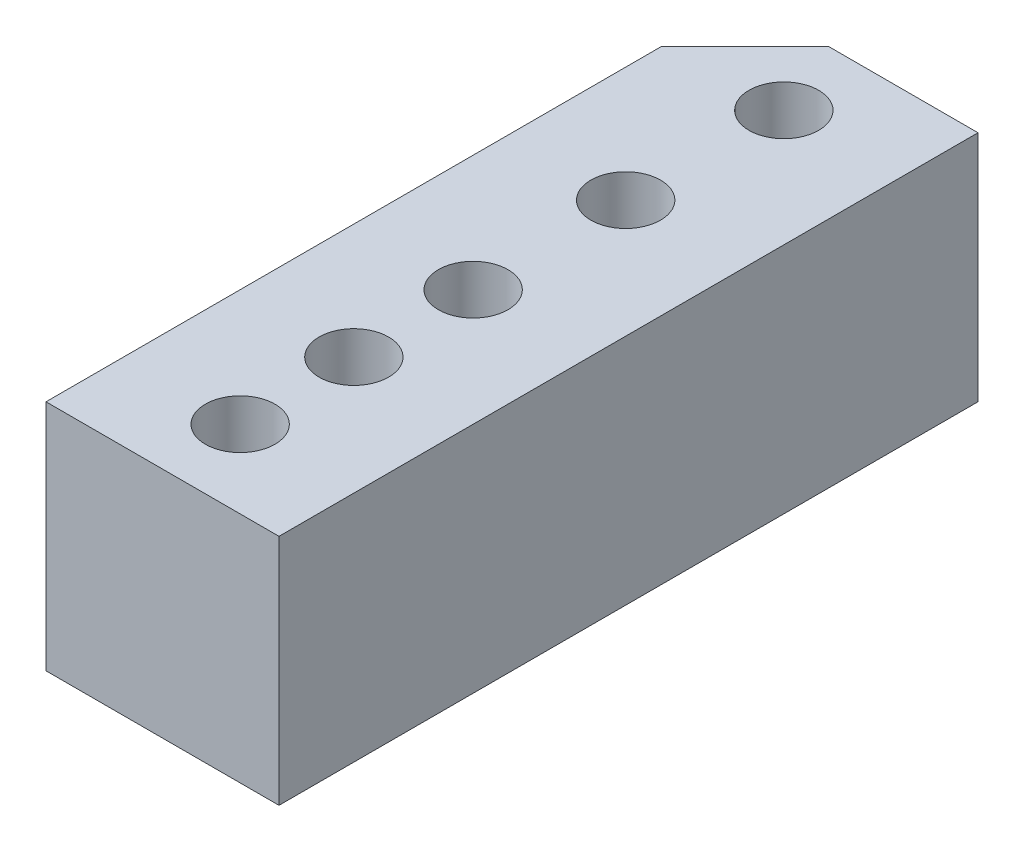
ISO-10303-21;
HEADER;
FILE_DESCRIPTION(('STEP AP214'),'2;1');
FILE_NAME('part.step','',(''),(''),'','','');
FILE_SCHEMA(('AUTOMOTIVE_DESIGN { 1 0 10303 214 1 1 1 1 }'));
ENDSEC;
DATA;
#1=APPLICATION_CONTEXT('core data for automotive mechanical design processes');
#2=APPLICATION_PROTOCOL_DEFINITION('international standard','automotive_design',2000,#1);
#3=PRODUCT_CONTEXT('',#1,'mechanical');
#4=PRODUCT('Part','Part','',(#3));
#5=PRODUCT_RELATED_PRODUCT_CATEGORY('part','',(#4));
#6=PRODUCT_DEFINITION_FORMATION('','',#4);
#7=PRODUCT_DEFINITION_CONTEXT('part definition',#1,'design');
#8=PRODUCT_DEFINITION('design','',#6,#7);
#9=PRODUCT_DEFINITION_SHAPE('','',#8);
#10=(LENGTH_UNIT() NAMED_UNIT(*) SI_UNIT(.MILLI.,.METRE.));
#11=(NAMED_UNIT(*) PLANE_ANGLE_UNIT() SI_UNIT($,.RADIAN.));
#12=(NAMED_UNIT(*) SI_UNIT($,.STERADIAN.) SOLID_ANGLE_UNIT());
#13=UNCERTAINTY_MEASURE_WITH_UNIT(LENGTH_MEASURE(1.E-05),#10,'distance_accuracy_value','');
#14=(GEOMETRIC_REPRESENTATION_CONTEXT(3) GLOBAL_UNCERTAINTY_ASSIGNED_CONTEXT((#13)) GLOBAL_UNIT_ASSIGNED_CONTEXT((#10,
#11,#12)) REPRESENTATION_CONTEXT('',''));
#15=CARTESIAN_POINT('',(0.,0.,0.));
#16=DIRECTION('',(0.,0.,1.));
#17=DIRECTION('',(1.,0.,0.));
#18=AXIS2_PLACEMENT_3D('',#15,#16,#17);
#19=CARTESIAN_POINT('',(4.7625,-4.7625,28.575));
#20=DIRECTION('',(-1.,0.,0.));
#21=DIRECTION('',(0.,0.,1.));
#22=AXIS2_PLACEMENT_3D('',#19,#20,#21);
#23=PLANE('',#22);
#24=DIRECTION('',(0.,1.,0.));
#25=VECTOR('',#24,1.);
#26=CARTESIAN_POINT('',(4.7625,-4.7625,0.));
#27=LINE('',#26,#25);
#28=CARTESIAN_POINT('',(4.7625,-4.7625,0.));
#29=VERTEX_POINT('',#28);
#30=CARTESIAN_POINT('',(4.7625,4.7625,0.));
#31=VERTEX_POINT('',#30);
#32=EDGE_CURVE('E99',#29,#31,#27,.T.);
#33=ORIENTED_EDGE('',*,*,#32,.T.);
#34=DIRECTION('',(0.,0.,-1.));
#35=VECTOR('',#34,1.);
#36=CARTESIAN_POINT('',(4.7625,4.7625,28.575));
#37=LINE('',#36,#35);
#38=CARTESIAN_POINT('',(4.7625,4.7625,28.575));
#39=VERTEX_POINT('',#38);
#40=EDGE_CURVE('E80',#39,#31,#37,.T.);
#41=ORIENTED_EDGE('',*,*,#40,.F.);
#42=DIRECTION('',(0.,1.,0.));
#43=VECTOR('',#42,1.);
#44=CARTESIAN_POINT('',(4.7625,-4.7625,28.575));
#45=LINE('',#44,#43);
#46=CARTESIAN_POINT('',(4.7625,-4.7625,28.575));
#47=VERTEX_POINT('',#46);
#48=EDGE_CURVE('E87',#47,#39,#45,.T.);
#49=ORIENTED_EDGE('',*,*,#48,.F.);
#50=DIRECTION('',(0.,0.,-1.));
#51=VECTOR('',#50,1.);
#52=CARTESIAN_POINT('',(4.7625,-4.7625,28.575));
#53=LINE('',#52,#51);
#54=EDGE_CURVE('E109',#47,#29,#53,.T.);
#55=ORIENTED_EDGE('',*,*,#54,.T.);
#56=EDGE_LOOP('',(#33,#41,#49,#55));
#57=FACE_BOUND('',#56,.T.);
#58=ADVANCED_FACE('F31',(#57),#23,.F.);
#59=CARTESIAN_POINT('',(-4.7625,4.7625,28.575));
#60=DIRECTION('',(0.,-1.,0.));
#61=DIRECTION('',(0.,0.,-1.));
#62=AXIS2_PLACEMENT_3D('',#59,#60,#61);
#63=PLANE('',#62);
#64=CARTESIAN_POINT('',(-0.053117727579443,4.7625,20.6996320516497));
#65=DIRECTION('',(0.,-1.,0.));
#66=DIRECTION('',(0.,0.,-1.));
#67=AXIS2_PLACEMENT_3D('',#64,#65,#66);
#68=CIRCLE('',#67,1.4224);
#69=CARTESIAN_POINT('',(-0.053117727579443,4.7625,19.2772320516497));
#70=VERTEX_POINT('',#69);
#71=EDGE_CURVE('E141',#70,#70,#68,.T.);
#72=ORIENTED_EDGE('',*,*,#71,.T.);
#73=EDGE_LOOP('',(#72));
#74=FACE_BOUND('',#73,.T.);
#75=CARTESIAN_POINT('',(-0.053117727579443,4.7625,9.5871320516497));
#76=DIRECTION('',(0.,-1.,0.));
#77=DIRECTION('',(0.,0.,-1.));
#78=AXIS2_PLACEMENT_3D('',#75,#76,#77);
#79=CIRCLE('',#78,1.4224);
#80=CARTESIAN_POINT('',(-0.053117727579443,4.7625,8.1647320516497));
#81=VERTEX_POINT('',#80);
#82=EDGE_CURVE('E135',#81,#81,#79,.T.);
#83=ORIENTED_EDGE('',*,*,#82,.T.);
#84=EDGE_LOOP('',(#83));
#85=FACE_BOUND('',#84,.T.);
#86=CARTESIAN_POINT('',(0.,4.7625,3.175));
#87=DIRECTION('',(0.,1.,0.));
#88=DIRECTION('',(0.,0.,1.));
#89=AXIS2_PLACEMENT_3D('',#86,#87,#88);
#90=CIRCLE('',#89,1.42239999999999);
#91=CARTESIAN_POINT('',(0.,4.7625,4.59739999999999));
#92=VERTEX_POINT('',#91);
#93=EDGE_CURVE('E132',#92,#92,#90,.T.);
#94=ORIENTED_EDGE('',*,*,#93,.F.);
#95=EDGE_LOOP('',(#94));
#96=FACE_BOUND('',#95,.T.);
#97=CARTESIAN_POINT('',(0.,4.7625,15.875));
#98=DIRECTION('',(0.,1.,0.));
#99=DIRECTION('',(0.,0.,1.));
#100=AXIS2_PLACEMENT_3D('',#97,#98,#99);
#101=CIRCLE('',#100,1.42239999999999);
#102=CARTESIAN_POINT('',(0.,4.7625,17.2974));
#103=VERTEX_POINT('',#102);
#104=EDGE_CURVE('E126',#103,#103,#101,.T.);
#105=ORIENTED_EDGE('',*,*,#104,.F.);
#106=EDGE_LOOP('',(#105));
#107=FACE_BOUND('',#106,.T.);
#108=CARTESIAN_POINT('',(0.,4.7625,25.4));
#109=DIRECTION('',(0.,1.,0.));
#110=DIRECTION('',(0.,0.,1.));
#111=AXIS2_PLACEMENT_3D('',#108,#109,#110);
#112=CIRCLE('',#111,1.42239999999999);
#113=CARTESIAN_POINT('',(0.,4.7625,26.8224));
#114=VERTEX_POINT('',#113);
#115=EDGE_CURVE('E120',#114,#114,#112,.T.);
#116=ORIENTED_EDGE('',*,*,#115,.F.);
#117=EDGE_LOOP('',(#116));
#118=FACE_BOUND('',#117,.T.);
#119=DIRECTION('',(-1.,0.,0.));
#120=VECTOR('',#119,1.);
#121=CARTESIAN_POINT('',(-4.7625,4.7625,0.));
#122=LINE('',#121,#120);
#123=CARTESIAN_POINT('',(-1.33349999999999,4.7625,0.));
#124=VERTEX_POINT('',#123);
#125=EDGE_CURVE('E112',#31,#124,#122,.T.);
#126=ORIENTED_EDGE('',*,*,#125,.T.);
#127=DIRECTION('',(-0.707106781186549,0.,0.707106781186546));
#128=VECTOR('',#127,1.);
#129=CARTESIAN_POINT('',(-4.7625,4.7625,3.429));
#130=LINE('',#129,#128);
#131=CARTESIAN_POINT('',(-4.7625,4.7625,3.42900000000001));
#132=VERTEX_POINT('',#131);
#133=EDGE_CURVE('E11',#124,#132,#130,.T.);
#134=ORIENTED_EDGE('',*,*,#133,.T.);
#135=DIRECTION('',(0.,0.,-1.));
#136=VECTOR('',#135,1.);
#137=CARTESIAN_POINT('',(-4.7625,4.7625,28.575));
#138=LINE('',#137,#136);
#139=CARTESIAN_POINT('',(-4.7625,4.7625,28.575));
#140=VERTEX_POINT('',#139);
#141=EDGE_CURVE('E83',#140,#132,#138,.T.);
#142=ORIENTED_EDGE('',*,*,#141,.F.);
#143=DIRECTION('',(-1.,0.,0.));
#144=VECTOR('',#143,1.);
#145=CARTESIAN_POINT('',(-4.7625,4.7625,28.575));
#146=LINE('',#145,#144);
#147=EDGE_CURVE('E76',#39,#140,#146,.T.);
#148=ORIENTED_EDGE('',*,*,#147,.F.);
#149=ORIENTED_EDGE('',*,*,#40,.T.);
#150=EDGE_LOOP('',(#126,#134,#142,#148,#149));
#151=FACE_BOUND('',#150,.T.);
#152=ADVANCED_FACE('F78',(#74,#85,#96,#107,#118,#151),#63,.F.);
#153=CARTESIAN_POINT('',(-4.7625,-4.7625,28.575));
#154=DIRECTION('',(1.,0.,0.));
#155=DIRECTION('',(0.,0.,-1.));
#156=AXIS2_PLACEMENT_3D('',#153,#154,#155);
#157=PLANE('',#156);
#158=ORIENTED_EDGE('',*,*,#141,.T.);
#159=DIRECTION('',(0.,-1.,0.));
#160=VECTOR('',#159,1.);
#161=CARTESIAN_POINT('',(-4.7625,-4.7625,3.429));
#162=LINE('',#161,#160);
#163=CARTESIAN_POINT('',(-4.7625,-4.7625,3.42900000000001));
#164=VERTEX_POINT('',#163);
#165=EDGE_CURVE('E100',#132,#164,#162,.T.);
#166=ORIENTED_EDGE('',*,*,#165,.T.);
#167=DIRECTION('',(0.,0.,-1.));
#168=VECTOR('',#167,1.);
#169=CARTESIAN_POINT('',(-4.7625,-4.7625,28.575));
#170=LINE('',#169,#168);
#171=CARTESIAN_POINT('',(-4.7625,-4.7625,28.575));
#172=VERTEX_POINT('',#171);
#173=EDGE_CURVE('E104',#172,#164,#170,.T.);
#174=ORIENTED_EDGE('',*,*,#173,.F.);
#175=DIRECTION('',(0.,-1.,0.));
#176=VECTOR('',#175,1.);
#177=CARTESIAN_POINT('',(-4.7625,-4.7625,28.575));
#178=LINE('',#177,#176);
#179=EDGE_CURVE('E86',#140,#172,#178,.T.);
#180=ORIENTED_EDGE('',*,*,#179,.F.);
#181=EDGE_LOOP('',(#158,#166,#174,#180));
#182=FACE_BOUND('',#181,.T.);
#183=ADVANCED_FACE('F153',(#182),#157,.F.);
#184=CARTESIAN_POINT('',(-4.7625,-4.7625,28.575));
#185=DIRECTION('',(0.,1.,0.));
#186=DIRECTION('',(0.,0.,1.));
#187=AXIS2_PLACEMENT_3D('',#184,#185,#186);
#188=PLANE('',#187);
#189=CARTESIAN_POINT('',(-0.053117727579443,-4.7625,20.6996320516497));
#190=DIRECTION('',(0.,-1.,0.));
#191=DIRECTION('',(0.,0.,-1.));
#192=AXIS2_PLACEMENT_3D('',#189,#190,#191);
#193=CIRCLE('',#192,1.42239999999999);
#194=CARTESIAN_POINT('',(-0.053117727579443,-4.7625,19.2772320516497));
#195=VERTEX_POINT('',#194);
#196=EDGE_CURVE('E144',#195,#195,#193,.T.);
#197=ORIENTED_EDGE('',*,*,#196,.F.);
#198=EDGE_LOOP('',(#197));
#199=FACE_BOUND('',#198,.T.);
#200=CARTESIAN_POINT('',(-0.053117727579443,-4.7625,9.5871320516497));
#201=DIRECTION('',(0.,-1.,0.));
#202=DIRECTION('',(0.,0.,-1.));
#203=AXIS2_PLACEMENT_3D('',#200,#201,#202);
#204=CIRCLE('',#203,1.42239999999999);
#205=CARTESIAN_POINT('',(-0.053117727579443,-4.7625,8.16473205164971));
#206=VERTEX_POINT('',#205);
#207=EDGE_CURVE('E138',#206,#206,#204,.T.);
#208=ORIENTED_EDGE('',*,*,#207,.F.);
#209=EDGE_LOOP('',(#208));
#210=FACE_BOUND('',#209,.T.);
#211=CARTESIAN_POINT('',(0.,-4.7625,3.175));
#212=DIRECTION('',(0.,1.,0.));
#213=DIRECTION('',(0.,0.,1.));
#214=AXIS2_PLACEMENT_3D('',#211,#212,#213);
#215=CIRCLE('',#214,1.4224);
#216=CARTESIAN_POINT('',(0.,-4.7625,4.5974));
#217=VERTEX_POINT('',#216);
#218=EDGE_CURVE('E129',#217,#217,#215,.T.);
#219=ORIENTED_EDGE('',*,*,#218,.T.);
#220=EDGE_LOOP('',(#219));
#221=FACE_BOUND('',#220,.T.);
#222=CARTESIAN_POINT('',(0.,-4.7625,15.875));
#223=DIRECTION('',(0.,1.,0.));
#224=DIRECTION('',(0.,0.,1.));
#225=AXIS2_PLACEMENT_3D('',#222,#223,#224);
#226=CIRCLE('',#225,1.4224);
#227=CARTESIAN_POINT('',(0.,-4.7625,17.2974));
#228=VERTEX_POINT('',#227);
#229=EDGE_CURVE('E123',#228,#228,#226,.T.);
#230=ORIENTED_EDGE('',*,*,#229,.T.);
#231=EDGE_LOOP('',(#230));
#232=FACE_BOUND('',#231,.T.);
#233=CARTESIAN_POINT('',(0.,-4.7625,25.4));
#234=DIRECTION('',(0.,1.,0.));
#235=DIRECTION('',(0.,0.,1.));
#236=AXIS2_PLACEMENT_3D('',#233,#234,#235);
#237=CIRCLE('',#236,1.4224);
#238=CARTESIAN_POINT('',(0.,-4.7625,26.8224));
#239=VERTEX_POINT('',#238);
#240=EDGE_CURVE('E115',#239,#239,#237,.T.);
#241=ORIENTED_EDGE('',*,*,#240,.T.);
#242=EDGE_LOOP('',(#241));
#243=FACE_BOUND('',#242,.T.);
#244=ORIENTED_EDGE('',*,*,#173,.T.);
#245=DIRECTION('',(0.707106781186549,0.,-0.707106781186546));
#246=VECTOR('',#245,1.);
#247=CARTESIAN_POINT('',(-4.7625,-4.7625,3.429));
#248=LINE('',#247,#246);
#249=CARTESIAN_POINT('',(-1.33349999999999,-4.7625,0.));
#250=VERTEX_POINT('',#249);
#251=EDGE_CURVE('E53',#164,#250,#248,.T.);
#252=ORIENTED_EDGE('',*,*,#251,.T.);
#253=DIRECTION('',(1.,0.,0.));
#254=VECTOR('',#253,1.);
#255=CARTESIAN_POINT('',(-4.7625,-4.7625,0.));
#256=LINE('',#255,#254);
#257=EDGE_CURVE('E96',#250,#29,#256,.T.);
#258=ORIENTED_EDGE('',*,*,#257,.T.);
#259=ORIENTED_EDGE('',*,*,#54,.F.);
#260=DIRECTION('',(1.,0.,0.));
#261=VECTOR('',#260,1.);
#262=CARTESIAN_POINT('',(-4.7625,-4.7625,28.575));
#263=LINE('',#262,#261);
#264=EDGE_CURVE('E92',#172,#47,#263,.T.);
#265=ORIENTED_EDGE('',*,*,#264,.F.);
#266=EDGE_LOOP('',(#244,#252,#258,#259,#265));
#267=FACE_BOUND('',#266,.T.);
#268=ADVANCED_FACE('F150',(#199,#210,#221,#232,#243,#267),#188,.F.);
#269=CARTESIAN_POINT('',(4.7625,4.7625,28.575));
#270=DIRECTION('',(0.,0.,-1.));
#271=DIRECTION('',(-1.,0.,0.));
#272=AXIS2_PLACEMENT_3D('',#269,#270,#271);
#273=PLANE('',#272);
#274=ORIENTED_EDGE('',*,*,#48,.T.);
#275=ORIENTED_EDGE('',*,*,#147,.T.);
#276=ORIENTED_EDGE('',*,*,#179,.T.);
#277=ORIENTED_EDGE('',*,*,#264,.T.);
#278=EDGE_LOOP('',(#274,#275,#276,#277));
#279=FACE_BOUND('',#278,.T.);
#280=ADVANCED_FACE('F90',(#279),#273,.F.);
#281=CARTESIAN_POINT('',(4.7625,4.7625,0.));
#282=DIRECTION('',(0.,0.,-1.));
#283=DIRECTION('',(-1.,0.,0.));
#284=AXIS2_PLACEMENT_3D('',#281,#282,#283);
#285=PLANE('',#284);
#286=ORIENTED_EDGE('',*,*,#257,.F.);
#287=DIRECTION('',(0.,1.,0.));
#288=VECTOR('',#287,1.);
#289=CARTESIAN_POINT('',(-1.33349999999999,4.7625,0.));
#290=LINE('',#289,#288);
#291=EDGE_CURVE('E39',#250,#124,#290,.T.);
#292=ORIENTED_EDGE('',*,*,#291,.T.);
#293=ORIENTED_EDGE('',*,*,#125,.F.);
#294=ORIENTED_EDGE('',*,*,#32,.F.);
#295=EDGE_LOOP('',(#286,#292,#293,#294));
#296=FACE_BOUND('',#295,.T.);
#297=ADVANCED_FACE('F167',(#296),#285,.T.);
#298=CARTESIAN_POINT('',(0.,4.7625,25.4));
#299=DIRECTION('',(0.,1.,0.));
#300=DIRECTION('',(0.,0.,1.));
#301=AXIS2_PLACEMENT_3D('',#298,#299,#300);
#302=CYLINDRICAL_SURFACE('',#301,1.42239999999999);
#303=ORIENTED_EDGE('',*,*,#240,.F.);
#304=EDGE_LOOP('',(#303));
#305=FACE_BOUND('',#304,.T.);
#306=ORIENTED_EDGE('',*,*,#115,.T.);
#307=EDGE_LOOP('',(#306));
#308=FACE_BOUND('',#307,.T.);
#309=ADVANCED_FACE('F169',(#305,#308),#302,.F.);
#310=CARTESIAN_POINT('',(0.,4.7625,15.875));
#311=DIRECTION('',(0.,1.,0.));
#312=DIRECTION('',(0.,0.,1.));
#313=AXIS2_PLACEMENT_3D('',#310,#311,#312);
#314=CYLINDRICAL_SURFACE('',#313,1.42239999999999);
#315=ORIENTED_EDGE('',*,*,#229,.F.);
#316=EDGE_LOOP('',(#315));
#317=FACE_BOUND('',#316,.T.);
#318=ORIENTED_EDGE('',*,*,#104,.T.);
#319=EDGE_LOOP('',(#318));
#320=FACE_BOUND('',#319,.T.);
#321=ADVANCED_FACE('F175',(#317,#320),#314,.F.);
#322=CARTESIAN_POINT('',(0.,4.7625,3.175));
#323=DIRECTION('',(0.,1.,0.));
#324=DIRECTION('',(0.,0.,1.));
#325=AXIS2_PLACEMENT_3D('',#322,#323,#324);
#326=CYLINDRICAL_SURFACE('',#325,1.42239999999999);
#327=ORIENTED_EDGE('',*,*,#218,.F.);
#328=EDGE_LOOP('',(#327));
#329=FACE_BOUND('',#328,.T.);
#330=ORIENTED_EDGE('',*,*,#93,.T.);
#331=EDGE_LOOP('',(#330));
#332=FACE_BOUND('',#331,.T.);
#333=ADVANCED_FACE('F217',(#329,#332),#326,.F.);
#334=CARTESIAN_POINT('',(-0.053117727579443,-4.7625,9.5871320516497));
#335=DIRECTION('',(0.,-1.,0.));
#336=DIRECTION('',(0.,0.,-1.));
#337=AXIS2_PLACEMENT_3D('',#334,#335,#336);
#338=CYLINDRICAL_SURFACE('',#337,1.42239999999999);
#339=ORIENTED_EDGE('',*,*,#82,.F.);
#340=EDGE_LOOP('',(#339));
#341=FACE_BOUND('',#340,.T.);
#342=ORIENTED_EDGE('',*,*,#207,.T.);
#343=EDGE_LOOP('',(#342));
#344=FACE_BOUND('',#343,.T.);
#345=ADVANCED_FACE('F227',(#341,#344),#338,.F.);
#346=CARTESIAN_POINT('',(-0.053117727579443,-4.7625,20.6996320516497));
#347=DIRECTION('',(0.,-1.,0.));
#348=DIRECTION('',(0.,0.,-1.));
#349=AXIS2_PLACEMENT_3D('',#346,#347,#348);
#350=CYLINDRICAL_SURFACE('',#349,1.42239999999999);
#351=ORIENTED_EDGE('',*,*,#71,.F.);
#352=EDGE_LOOP('',(#351));
#353=FACE_BOUND('',#352,.T.);
#354=ORIENTED_EDGE('',*,*,#196,.T.);
#355=EDGE_LOOP('',(#354));
#356=FACE_BOUND('',#355,.T.);
#357=ADVANCED_FACE('F148',(#353,#356),#350,.F.);
#358=CARTESIAN_POINT('',(-4.7625,-4.7625,3.429));
#359=DIRECTION('',(-0.707106781186546,0.,-0.707106781186549));
#360=DIRECTION('',(-0.707106781186549,0.,0.707106781186546));
#361=AXIS2_PLACEMENT_3D('',#358,#359,#360);
#362=PLANE('',#361);
#363=ORIENTED_EDGE('',*,*,#133,.F.);
#364=ORIENTED_EDGE('',*,*,#291,.F.);
#365=ORIENTED_EDGE('',*,*,#251,.F.);
#366=ORIENTED_EDGE('',*,*,#165,.F.);
#367=EDGE_LOOP('',(#363,#364,#365,#366));
#368=FACE_BOUND('',#367,.T.);
#369=ADVANCED_FACE('F33',(#368),#362,.T.);
#370=CLOSED_SHELL('',(#58,#152,#183,#268,#280,#297,#309,#321,#333,#345,#357,#369));
#371=MANIFOLD_SOLID_BREP('B2',#370);
#372=ADVANCED_BREP_SHAPE_REPRESENTATION('',(#18,#371),#14);
#373=SHAPE_DEFINITION_REPRESENTATION(#9,#372);
ENDSEC;
END-ISO-10303-21;
